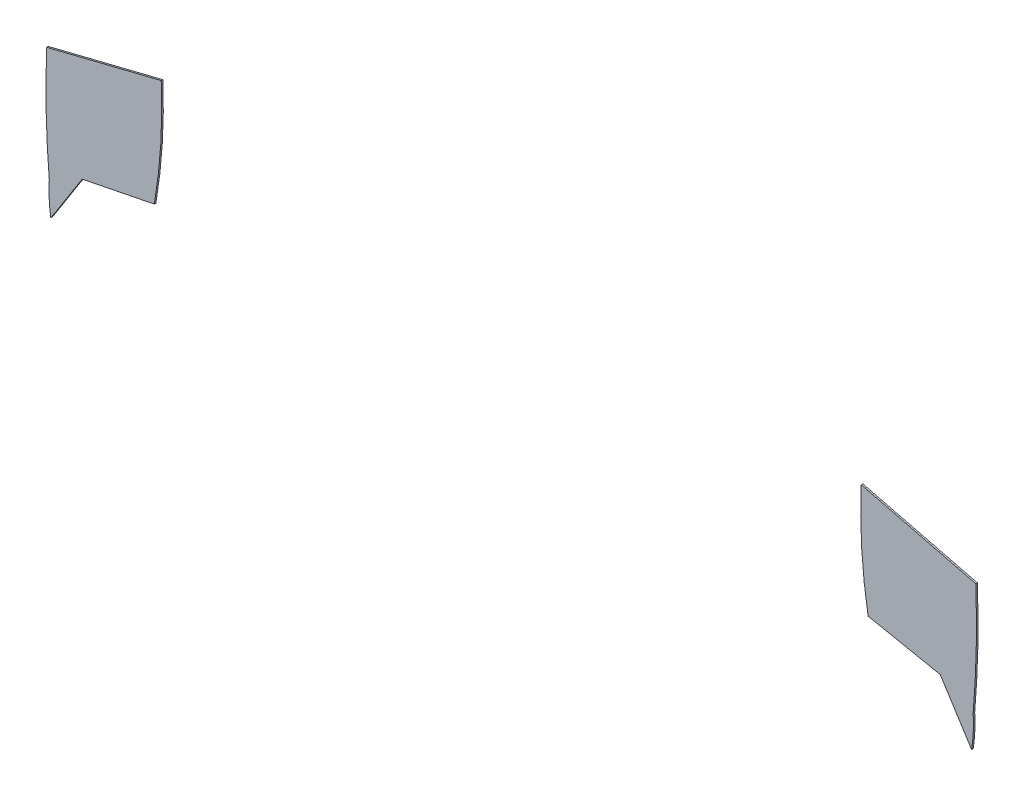
ISO-10303-21;
HEADER;
FILE_DESCRIPTION(('STEP AP214'),'2;1');
FILE_NAME('part.step','',(''),(''),'','','');
FILE_SCHEMA(('AUTOMOTIVE_DESIGN { 1 0 10303 214 1 1 1 1 }'));
ENDSEC;
DATA;
#1=APPLICATION_CONTEXT('core data for automotive mechanical design processes');
#2=APPLICATION_PROTOCOL_DEFINITION('international standard','automotive_design',2000,#1);
#3=PRODUCT_CONTEXT('',#1,'mechanical');
#4=PRODUCT('Part','Part','',(#3));
#5=PRODUCT_RELATED_PRODUCT_CATEGORY('part','',(#4));
#6=PRODUCT_DEFINITION_FORMATION('','',#4);
#7=PRODUCT_DEFINITION_CONTEXT('part definition',#1,'design');
#8=PRODUCT_DEFINITION('design','',#6,#7);
#9=PRODUCT_DEFINITION_SHAPE('','',#8);
#10=(LENGTH_UNIT() NAMED_UNIT(*) SI_UNIT(.MILLI.,.METRE.));
#11=(NAMED_UNIT(*) PLANE_ANGLE_UNIT() SI_UNIT($,.RADIAN.));
#12=(NAMED_UNIT(*) SI_UNIT($,.STERADIAN.) SOLID_ANGLE_UNIT());
#13=UNCERTAINTY_MEASURE_WITH_UNIT(LENGTH_MEASURE(1.E-05),#10,'distance_accuracy_value','');
#14=(GEOMETRIC_REPRESENTATION_CONTEXT(3) GLOBAL_UNCERTAINTY_ASSIGNED_CONTEXT((#13)) GLOBAL_UNIT_ASSIGNED_CONTEXT((#10,
#11,#12)) REPRESENTATION_CONTEXT('',''));
#15=CARTESIAN_POINT('',(0.,0.,0.));
#16=DIRECTION('',(0.,0.,1.));
#17=DIRECTION('',(1.,0.,0.));
#18=AXIS2_PLACEMENT_3D('',#15,#16,#17);
#19=CARTESIAN_POINT('',(90.4391239036947,-2.83923095815761,0.1));
#20=DIRECTION('',(0.,0.,-1.));
#21=DIRECTION('',(-1.,0.,0.));
#22=AXIS2_PLACEMENT_3D('',#19,#20,#21);
#23=CYLINDRICAL_SURFACE('',#22,33.1285196167318);
#24=CARTESIAN_POINT('',(90.4391239036947,-2.83923095815761,0.));
#25=DIRECTION('',(0.,0.,1.));
#26=DIRECTION('',(1.,0.,0.));
#27=AXIS2_PLACEMENT_3D('',#24,#25,#26);
#28=CIRCLE('',#27,33.1285196167318);
#29=CARTESIAN_POINT('',(57.3442733626371,-1.34601976705404,0.));
#30=VERTEX_POINT('',#29);
#31=CARTESIAN_POINT('',(57.7848375541781,-8.42460426707408,0.));
#32=VERTEX_POINT('',#31);
#33=EDGE_CURVE('E127',#30,#32,#28,.T.);
#34=ORIENTED_EDGE('',*,*,#33,.T.);
#35=DIRECTION('',(0.,0.,-1.));
#36=VECTOR('',#35,1.);
#37=CARTESIAN_POINT('',(57.7848375541781,-8.42460426707408,0.1));
#38=LINE('',#37,#36);
#39=CARTESIAN_POINT('',(57.7848375541781,-8.42460426707408,0.1));
#40=VERTEX_POINT('',#39);
#41=EDGE_CURVE('E12',#40,#32,#38,.T.);
#42=ORIENTED_EDGE('',*,*,#41,.F.);
#43=CARTESIAN_POINT('',(90.4391239036947,-2.83923095815761,0.1));
#44=DIRECTION('',(0.,0.,1.));
#45=DIRECTION('',(1.,0.,0.));
#46=AXIS2_PLACEMENT_3D('',#43,#44,#45);
#47=CIRCLE('',#46,33.1285196167318);
#48=CARTESIAN_POINT('',(57.3442733626371,-1.34601976705404,0.1));
#49=VERTEX_POINT('',#48);
#50=EDGE_CURVE('E137',#49,#40,#47,.T.);
#51=ORIENTED_EDGE('',*,*,#50,.F.);
#52=DIRECTION('',(0.,0.,-1.));
#53=VECTOR('',#52,1.);
#54=CARTESIAN_POINT('',(57.3442733626371,-1.34601976705404,0.1));
#55=LINE('',#54,#53);
#56=EDGE_CURVE('E123',#49,#30,#55,.T.);
#57=ORIENTED_EDGE('',*,*,#56,.T.);
#58=EDGE_LOOP('',(#34,#42,#51,#57));
#59=FACE_BOUND('',#58,.T.);
#60=ADVANCED_FACE('F43',(#59),#23,.T.);
#61=CARTESIAN_POINT('',(62.4057938002253,-9.3487955162835,0.1));
#62=DIRECTION('',(0.196116135138183,0.98058067569092,0.));
#63=DIRECTION('',(-0.98058067569092,0.196116135138183,0.));
#64=AXIS2_PLACEMENT_3D('',#61,#62,#63);
#65=PLANE('',#64);
#66=DIRECTION('',(0.98058067569092,-0.196116135138183,0.));
#67=VECTOR('',#66,1.);
#68=CARTESIAN_POINT('',(62.4057938002253,-9.3487955162835,0.));
#69=LINE('',#68,#67);
#70=CARTESIAN_POINT('',(62.4057938002253,-9.3487955162835,0.));
#71=VERTEX_POINT('',#70);
#72=EDGE_CURVE('E130',#32,#71,#69,.T.);
#73=ORIENTED_EDGE('',*,*,#72,.T.);
#74=DIRECTION('',(0.,0.,-1.));
#75=VECTOR('',#74,1.);
#76=CARTESIAN_POINT('',(62.4057938002253,-9.3487955162835,0.1));
#77=LINE('',#76,#75);
#78=CARTESIAN_POINT('',(62.4057938002253,-9.3487955162835,0.1));
#79=VERTEX_POINT('',#78);
#80=EDGE_CURVE('E51',#79,#71,#77,.T.);
#81=ORIENTED_EDGE('',*,*,#80,.F.);
#82=DIRECTION('',(0.98058067569092,-0.196116135138183,0.));
#83=VECTOR('',#82,1.);
#84=CARTESIAN_POINT('',(62.4057938002253,-9.3487955162835,0.1));
#85=LINE('',#84,#83);
#86=EDGE_CURVE('E95',#40,#79,#85,.T.);
#87=ORIENTED_EDGE('',*,*,#86,.F.);
#88=ORIENTED_EDGE('',*,*,#41,.T.);
#89=EDGE_LOOP('',(#73,#81,#87,#88));
#90=FACE_BOUND('',#89,.T.);
#91=ADVANCED_FACE('F161',(#90),#65,.F.);
#92=CARTESIAN_POINT('',(64.4194666396524,-12.5120472945828,0.1));
#93=DIRECTION('',(0.84357759621922,0.537007298979263,0.));
#94=DIRECTION('',(-0.537007298979263,0.84357759621922,0.));
#95=AXIS2_PLACEMENT_3D('',#92,#93,#94);
#96=PLANE('',#95);
#97=DIRECTION('',(0.537007298979263,-0.84357759621922,0.));
#98=VECTOR('',#97,1.);
#99=CARTESIAN_POINT('',(64.4194666396524,-12.5120472945828,0.));
#100=LINE('',#99,#98);
#101=CARTESIAN_POINT('',(64.4194666396524,-12.5120472945828,0.));
#102=VERTEX_POINT('',#101);
#103=EDGE_CURVE('E132',#71,#102,#100,.T.);
#104=ORIENTED_EDGE('',*,*,#103,.T.);
#105=DIRECTION('',(0.,0.,-1.));
#106=VECTOR('',#105,1.);
#107=CARTESIAN_POINT('',(64.4194666396524,-12.5120472945828,0.1));
#108=LINE('',#107,#106);
#109=CARTESIAN_POINT('',(64.4194666396524,-12.5120472945828,0.1));
#110=VERTEX_POINT('',#109);
#111=EDGE_CURVE('E118',#110,#102,#108,.T.);
#112=ORIENTED_EDGE('',*,*,#111,.F.);
#113=DIRECTION('',(0.537007298979263,-0.84357759621922,0.));
#114=VECTOR('',#113,1.);
#115=CARTESIAN_POINT('',(64.4194666396524,-12.5120472945828,0.1));
#116=LINE('',#115,#114);
#117=EDGE_CURVE('E108',#79,#110,#116,.T.);
#118=ORIENTED_EDGE('',*,*,#117,.F.);
#119=ORIENTED_EDGE('',*,*,#80,.T.);
#120=EDGE_LOOP('',(#104,#112,#118,#119));
#121=FACE_BOUND('',#120,.T.);
#122=ADVANCED_FACE('F143',(#121),#96,.F.);
#123=CARTESIAN_POINT('',(55.5715399284181,-11.0502256806477,0.1));
#124=DIRECTION('',(0.,0.,-1.));
#125=DIRECTION('',(-1.,0.,0.));
#126=AXIS2_PLACEMENT_3D('',#123,#124,#125);
#127=CYLINDRICAL_SURFACE('',#126,8.96787207303605);
#128=CARTESIAN_POINT('',(55.5715399284181,-11.0502256806477,0.));
#129=DIRECTION('',(0.,0.,1.));
#130=DIRECTION('',(1.,0.,0.));
#131=AXIS2_PLACEMENT_3D('',#128,#129,#130);
#132=CIRCLE('',#131,8.96787207303605);
#133=CARTESIAN_POINT('',(64.5173910559765,-10.422151543382,0.));
#134=VERTEX_POINT('',#133);
#135=EDGE_CURVE('E117',#102,#134,#132,.T.);
#136=ORIENTED_EDGE('',*,*,#135,.T.);
#137=DIRECTION('',(0.,0.,-1.));
#138=VECTOR('',#137,1.);
#139=CARTESIAN_POINT('',(64.5173910559765,-10.422151543382,0.1));
#140=LINE('',#139,#138);
#141=CARTESIAN_POINT('',(64.5173910559765,-10.422151543382,0.1));
#142=VERTEX_POINT('',#141);
#143=EDGE_CURVE('E114',#142,#134,#140,.T.);
#144=ORIENTED_EDGE('',*,*,#143,.F.);
#145=CARTESIAN_POINT('',(55.5715399284181,-11.0502256806477,0.1));
#146=DIRECTION('',(0.,0.,1.));
#147=DIRECTION('',(1.,0.,0.));
#148=AXIS2_PLACEMENT_3D('',#145,#146,#147);
#149=CIRCLE('',#148,8.96787207303605);
#150=EDGE_CURVE('E102',#110,#142,#149,.T.);
#151=ORIENTED_EDGE('',*,*,#150,.F.);
#152=ORIENTED_EDGE('',*,*,#111,.T.);
#153=EDGE_LOOP('',(#136,#144,#151,#152));
#154=FACE_BOUND('',#153,.T.);
#155=ADVANCED_FACE('F115',(#154),#127,.T.);
#156=CARTESIAN_POINT('',(6.9370145575896,-5.46520608903776,0.1));
#157=DIRECTION('',(0.,0.,-1.));
#158=DIRECTION('',(-1.,0.,0.));
#159=AXIS2_PLACEMENT_3D('',#156,#157,#158);
#160=CYLINDRICAL_SURFACE('',#159,57.7933479384378);
#161=CARTESIAN_POINT('',(6.9370145575896,-5.46520608903776,0.));
#162=DIRECTION('',(0.,0.,1.));
#163=DIRECTION('',(1.,0.,0.));
#164=AXIS2_PLACEMENT_3D('',#161,#162,#163);
#165=CIRCLE('',#164,57.7933479384378);
#166=CARTESIAN_POINT('',(64.6847099213511,-3.16852454656493,0.));
#167=VERTEX_POINT('',#166);
#168=EDGE_CURVE('E81',#134,#167,#165,.T.);
#169=ORIENTED_EDGE('',*,*,#168,.T.);
#170=DIRECTION('',(0.,0.,-1.));
#171=VECTOR('',#170,1.);
#172=CARTESIAN_POINT('',(64.6847099213511,-3.16852454656493,0.1));
#173=LINE('',#172,#171);
#174=CARTESIAN_POINT('',(64.6847099213511,-3.16852454656493,0.1));
#175=VERTEX_POINT('',#174);
#176=EDGE_CURVE('E119',#175,#167,#173,.T.);
#177=ORIENTED_EDGE('',*,*,#176,.F.);
#178=CARTESIAN_POINT('',(6.9370145575896,-5.46520608903776,0.1));
#179=DIRECTION('',(0.,0.,1.));
#180=DIRECTION('',(1.,0.,0.));
#181=AXIS2_PLACEMENT_3D('',#178,#179,#180);
#182=CIRCLE('',#181,57.7933479384378);
#183=EDGE_CURVE('E106',#142,#175,#182,.T.);
#184=ORIENTED_EDGE('',*,*,#183,.F.);
#185=ORIENTED_EDGE('',*,*,#143,.T.);
#186=EDGE_LOOP('',(#169,#177,#184,#185));
#187=FACE_BOUND('',#186,.T.);
#188=ADVANCED_FACE('F121',(#187),#160,.T.);
#189=CARTESIAN_POINT('',(57.3442733626371,-1.34601976705404,0.1));
#190=DIRECTION('',(-0.240966822794949,-0.970533353528928,0.));
#191=DIRECTION('',(0.970533353528928,-0.240966822794949,0.));
#192=AXIS2_PLACEMENT_3D('',#189,#190,#191);
#193=PLANE('',#192);
#194=DIRECTION('',(-0.970533353528928,0.240966822794949,0.));
#195=VECTOR('',#194,1.);
#196=CARTESIAN_POINT('',(57.3442733626371,-1.34601976705404,0.));
#197=LINE('',#196,#195);
#198=EDGE_CURVE('E87',#167,#30,#197,.T.);
#199=ORIENTED_EDGE('',*,*,#198,.T.);
#200=ORIENTED_EDGE('',*,*,#56,.F.);
#201=DIRECTION('',(-0.970533353528928,0.240966822794949,0.));
#202=VECTOR('',#201,1.);
#203=CARTESIAN_POINT('',(57.3442733626371,-1.34601976705404,0.1));
#204=LINE('',#203,#202);
#205=EDGE_CURVE('E59',#175,#49,#204,.T.);
#206=ORIENTED_EDGE('',*,*,#205,.F.);
#207=ORIENTED_EDGE('',*,*,#176,.T.);
#208=EDGE_LOOP('',(#199,#200,#206,#207));
#209=FACE_BOUND('',#208,.T.);
#210=ADVANCED_FACE('F150',(#209),#193,.F.);
#211=CARTESIAN_POINT('',(90.4391239036947,-2.83923095815761,0.1));
#212=DIRECTION('',(0.,0.,1.));
#213=DIRECTION('',(1.,0.,0.));
#214=AXIS2_PLACEMENT_3D('',#211,#212,#213);
#215=PLANE('',#214);
#216=ORIENTED_EDGE('',*,*,#50,.T.);
#217=ORIENTED_EDGE('',*,*,#86,.T.);
#218=ORIENTED_EDGE('',*,*,#117,.T.);
#219=ORIENTED_EDGE('',*,*,#150,.T.);
#220=ORIENTED_EDGE('',*,*,#183,.T.);
#221=ORIENTED_EDGE('',*,*,#205,.T.);
#222=EDGE_LOOP('',(#216,#217,#218,#219,#220,#221));
#223=FACE_BOUND('',#222,.T.);
#224=ADVANCED_FACE('F104',(#223),#215,.T.);
#225=CARTESIAN_POINT('',(90.4391239036947,-2.83923095815761,0.));
#226=DIRECTION('',(0.,0.,1.));
#227=DIRECTION('',(1.,0.,0.));
#228=AXIS2_PLACEMENT_3D('',#225,#226,#227);
#229=PLANE('',#228);
#230=ORIENTED_EDGE('',*,*,#33,.F.);
#231=ORIENTED_EDGE('',*,*,#198,.F.);
#232=ORIENTED_EDGE('',*,*,#168,.F.);
#233=ORIENTED_EDGE('',*,*,#135,.F.);
#234=ORIENTED_EDGE('',*,*,#103,.F.);
#235=ORIENTED_EDGE('',*,*,#72,.F.);
#236=EDGE_LOOP('',(#230,#231,#232,#233,#234,#235));
#237=FACE_BOUND('',#236,.T.);
#238=ADVANCED_FACE('F146',(#237),#229,.F.);
#239=CLOSED_SHELL('',(#60,#91,#122,#155,#188,#210,#224,#238));
#240=MANIFOLD_SOLID_BREP('B2',#239);
#241=CARTESIAN_POINT('',(63.0462782931808,-5.489167462537,0.1));
#242=DIRECTION('',(0.,0.,-1.));
#243=DIRECTION('',(-1.,0.,0.));
#244=AXIS2_PLACEMENT_3D('',#241,#242,#243);
#245=CYLINDRICAL_SURFACE('',#244,57.9645015328712);
#246=CARTESIAN_POINT('',(63.0462782931808,-5.489167462537,0.));
#247=DIRECTION('',(0.,0.,1.));
#248=DIRECTION('',(1.,0.,0.));
#249=AXIS2_PLACEMENT_3D('',#246,#247,#248);
#250=CIRCLE('',#249,57.9645015328712);
#251=CARTESIAN_POINT('',(5.12828966293286,-3.16752343713269,0.));
#252=VERTEX_POINT('',#251);
#253=CARTESIAN_POINT('',(5.29385373676021,-10.4430443089244,0.));
#254=VERTEX_POINT('',#253);
#255=EDGE_CURVE('E306',#252,#254,#250,.T.);
#256=ORIENTED_EDGE('',*,*,#255,.T.);
#257=DIRECTION('',(0.,0.,-1.));
#258=VECTOR('',#257,1.);
#259=CARTESIAN_POINT('',(5.29385373676021,-10.4430443089244,0.1));
#260=LINE('',#259,#258);
#261=CARTESIAN_POINT('',(5.29385373676021,-10.4430443089244,0.1));
#262=VERTEX_POINT('',#261);
#263=EDGE_CURVE('E41',#262,#254,#260,.T.);
#264=ORIENTED_EDGE('',*,*,#263,.F.);
#265=CARTESIAN_POINT('',(63.0462782931808,-5.489167462537,0.1));
#266=DIRECTION('',(0.,0.,1.));
#267=DIRECTION('',(1.,0.,0.));
#268=AXIS2_PLACEMENT_3D('',#265,#266,#267);
#269=CIRCLE('',#268,57.9645015328712);
#270=CARTESIAN_POINT('',(5.12828966293286,-3.16752343713269,0.1));
#271=VERTEX_POINT('',#270);
#272=EDGE_CURVE('E316',#271,#262,#269,.T.);
#273=ORIENTED_EDGE('',*,*,#272,.F.);
#274=DIRECTION('',(0.,0.,-1.));
#275=VECTOR('',#274,1.);
#276=CARTESIAN_POINT('',(5.12828966293286,-3.16752343713269,0.1));
#277=LINE('',#276,#275);
#278=EDGE_CURVE('E302',#271,#252,#277,.T.);
#279=ORIENTED_EDGE('',*,*,#278,.T.);
#280=EDGE_LOOP('',(#256,#264,#273,#279));
#281=FACE_BOUND('',#280,.T.);
#282=ADVANCED_FACE('F222',(#281),#245,.T.);
#283=CARTESIAN_POINT('',(14.209967819523,-11.0510297976185,0.1));
#284=DIRECTION('',(0.,0.,-1.));
#285=DIRECTION('',(-1.,0.,0.));
#286=AXIS2_PLACEMENT_3D('',#283,#284,#285);
#287=CYLINDRICAL_SURFACE('',#286,8.93681915959498);
#288=CARTESIAN_POINT('',(14.209967819523,-11.0510297976185,0.));
#289=DIRECTION('',(0.,0.,1.));
#290=DIRECTION('',(1.,0.,0.));
#291=AXIS2_PLACEMENT_3D('',#288,#289,#290);
#292=CIRCLE('',#291,8.93681915959498);
#293=CARTESIAN_POINT('',(5.39321882591242,-12.5110550970468,0.));
#294=VERTEX_POINT('',#293);
#295=EDGE_CURVE('E309',#254,#294,#292,.T.);
#296=ORIENTED_EDGE('',*,*,#295,.T.);
#297=DIRECTION('',(0.,0.,-1.));
#298=VECTOR('',#297,1.);
#299=CARTESIAN_POINT('',(5.39321882591242,-12.5110550970468,0.1));
#300=LINE('',#299,#298);
#301=CARTESIAN_POINT('',(5.39321882591242,-12.5110550970468,0.1));
#302=VERTEX_POINT('',#301);
#303=EDGE_CURVE('E230',#302,#294,#300,.T.);
#304=ORIENTED_EDGE('',*,*,#303,.F.);
#305=CARTESIAN_POINT('',(14.209967819523,-11.0510297976185,0.1));
#306=DIRECTION('',(0.,0.,1.));
#307=DIRECTION('',(1.,0.,0.));
#308=AXIS2_PLACEMENT_3D('',#305,#306,#307);
#309=CIRCLE('',#308,8.93681915959498);
#310=EDGE_CURVE('E275',#262,#302,#309,.T.);
#311=ORIENTED_EDGE('',*,*,#310,.F.);
#312=ORIENTED_EDGE('',*,*,#263,.T.);
#313=EDGE_LOOP('',(#296,#304,#311,#312));
#314=FACE_BOUND('',#313,.T.);
#315=ADVANCED_FACE('F340',(#314),#287,.T.);
#316=CARTESIAN_POINT('',(5.39321882591242,-12.5110550970468,0.1));
#317=DIRECTION('',(-0.84355954217012,0.537035658791609,0.));
#318=DIRECTION('',(-0.537035658791609,-0.84355954217012,0.));
#319=AXIS2_PLACEMENT_3D('',#316,#317,#318);
#320=PLANE('',#319);
#321=DIRECTION('',(0.537035658791609,0.84355954217012,0.));
#322=VECTOR('',#321,1.);
#323=CARTESIAN_POINT('',(5.39321882591242,-12.5110550970468,0.));
#324=LINE('',#323,#322);
#325=CARTESIAN_POINT('',(7.40699800911539,-9.34787101791737,0.));
#326=VERTEX_POINT('',#325);
#327=EDGE_CURVE('E311',#294,#326,#324,.T.);
#328=ORIENTED_EDGE('',*,*,#327,.T.);
#329=DIRECTION('',(0.,0.,-1.));
#330=VECTOR('',#329,1.);
#331=CARTESIAN_POINT('',(7.40699800911539,-9.34787101791737,0.1));
#332=LINE('',#331,#330);
#333=CARTESIAN_POINT('',(7.40699800911539,-9.34787101791737,0.1));
#334=VERTEX_POINT('',#333);
#335=EDGE_CURVE('E297',#334,#326,#332,.T.);
#336=ORIENTED_EDGE('',*,*,#335,.F.);
#337=DIRECTION('',(0.537035658791609,0.84355954217012,0.));
#338=VECTOR('',#337,1.);
#339=CARTESIAN_POINT('',(5.39321882591242,-12.5110550970468,0.1));
#340=LINE('',#339,#338);
#341=EDGE_CURVE('E288',#302,#334,#340,.T.);
#342=ORIENTED_EDGE('',*,*,#341,.F.);
#343=ORIENTED_EDGE('',*,*,#303,.T.);
#344=EDGE_LOOP('',(#328,#336,#342,#343));
#345=FACE_BOUND('',#344,.T.);
#346=ADVANCED_FACE('F322',(#345),#320,.F.);
#347=CARTESIAN_POINT('',(7.40699800911539,-9.34787101791737,0.1));
#348=DIRECTION('',(-0.196083169024405,0.980587268337371,0.));
#349=DIRECTION('',(-0.980587268337371,-0.196083169024405,0.));
#350=AXIS2_PLACEMENT_3D('',#347,#348,#349);
#351=PLANE('',#350);
#352=DIRECTION('',(0.980587268337371,0.196083169024405,0.));
#353=VECTOR('',#352,1.);
#354=CARTESIAN_POINT('',(7.40699800911539,-9.34787101791737,0.));
#355=LINE('',#354,#353);
#356=CARTESIAN_POINT('',(12.027985322806,-8.42383512050423,0.));
#357=VERTEX_POINT('',#356);
#358=EDGE_CURVE('E296',#326,#357,#355,.T.);
#359=ORIENTED_EDGE('',*,*,#358,.T.);
#360=DIRECTION('',(0.,0.,-1.));
#361=VECTOR('',#360,1.);
#362=CARTESIAN_POINT('',(12.027985322806,-8.42383512050423,0.1));
#363=LINE('',#362,#361);
#364=CARTESIAN_POINT('',(12.027985322806,-8.42383512050423,0.1));
#365=VERTEX_POINT('',#364);
#366=EDGE_CURVE('E293',#365,#357,#363,.T.);
#367=ORIENTED_EDGE('',*,*,#366,.F.);
#368=DIRECTION('',(0.980587268337371,0.196083169024405,0.));
#369=VECTOR('',#368,1.);
#370=CARTESIAN_POINT('',(7.40699800911539,-9.34787101791737,0.1));
#371=LINE('',#370,#369);
#372=EDGE_CURVE('E282',#334,#365,#371,.T.);
#373=ORIENTED_EDGE('',*,*,#372,.F.);
#374=ORIENTED_EDGE('',*,*,#335,.T.);
#375=EDGE_LOOP('',(#359,#367,#373,#374));
#376=FACE_BOUND('',#375,.T.);
#377=ADVANCED_FACE('F294',(#376),#351,.F.);
#378=CARTESIAN_POINT('',(-20.4208720344938,-2.84211470326521,0.1));
#379=DIRECTION('',(0.,0.,-1.));
#380=DIRECTION('',(-1.,0.,0.));
#381=AXIS2_PLACEMENT_3D('',#378,#379,#380);
#382=CYLINDRICAL_SURFACE('',#381,32.9254300899869);
#383=CARTESIAN_POINT('',(-20.4208720344938,-2.84211470326521,0.));
#384=DIRECTION('',(0.,0.,1.));
#385=DIRECTION('',(1.,0.,0.));
#386=AXIS2_PLACEMENT_3D('',#383,#384,#385);
#387=CIRCLE('',#386,32.9254300899869);
#388=CARTESIAN_POINT('',(12.4705121397057,-1.34518661019316,0.));
#389=VERTEX_POINT('',#388);
#390=EDGE_CURVE('E261',#357,#389,#387,.T.);
#391=ORIENTED_EDGE('',*,*,#390,.T.);
#392=DIRECTION('',(0.,0.,-1.));
#393=VECTOR('',#392,1.);
#394=CARTESIAN_POINT('',(12.4705121397057,-1.34518661019316,0.1));
#395=LINE('',#394,#393);
#396=CARTESIAN_POINT('',(12.4705121397057,-1.34518661019316,0.1));
#397=VERTEX_POINT('',#396);
#398=EDGE_CURVE('E298',#397,#389,#395,.T.);
#399=ORIENTED_EDGE('',*,*,#398,.F.);
#400=CARTESIAN_POINT('',(-20.4208720344938,-2.84211470326521,0.1));
#401=DIRECTION('',(0.,0.,1.));
#402=DIRECTION('',(1.,0.,0.));
#403=AXIS2_PLACEMENT_3D('',#400,#401,#402);
#404=CIRCLE('',#403,32.9254300899869);
#405=EDGE_CURVE('E286',#365,#397,#404,.T.);
#406=ORIENTED_EDGE('',*,*,#405,.F.);
#407=ORIENTED_EDGE('',*,*,#366,.T.);
#408=EDGE_LOOP('',(#391,#399,#406,#407));
#409=FACE_BOUND('',#408,.T.);
#410=ADVANCED_FACE('F300',(#409),#382,.T.);
#411=CARTESIAN_POINT('',(12.4705121397057,-1.34518661019316,0.1));
#412=DIRECTION('',(0.240890699524116,-0.970552250465055,0.));
#413=DIRECTION('',(0.970552250465055,0.240890699524116,0.));
#414=AXIS2_PLACEMENT_3D('',#411,#412,#413);
#415=PLANE('',#414);
#416=DIRECTION('',(-0.970552250465055,-0.240890699524116,0.));
#417=VECTOR('',#416,1.);
#418=CARTESIAN_POINT('',(12.4705121397057,-1.34518661019316,0.));
#419=LINE('',#418,#417);
#420=EDGE_CURVE('E267',#389,#252,#419,.T.);
#421=ORIENTED_EDGE('',*,*,#420,.T.);
#422=ORIENTED_EDGE('',*,*,#278,.F.);
#423=DIRECTION('',(-0.970552250465055,-0.240890699524116,0.));
#424=VECTOR('',#423,1.);
#425=CARTESIAN_POINT('',(12.4705121397057,-1.34518661019316,0.1));
#426=LINE('',#425,#424);
#427=EDGE_CURVE('E238',#397,#271,#426,.T.);
#428=ORIENTED_EDGE('',*,*,#427,.F.);
#429=ORIENTED_EDGE('',*,*,#398,.T.);
#430=EDGE_LOOP('',(#421,#422,#428,#429));
#431=FACE_BOUND('',#430,.T.);
#432=ADVANCED_FACE('F329',(#431),#415,.F.);
#433=CARTESIAN_POINT('',(63.0462782931808,-5.489167462537,0.1));
#434=DIRECTION('',(0.,0.,1.));
#435=DIRECTION('',(1.,0.,0.));
#436=AXIS2_PLACEMENT_3D('',#433,#434,#435);
#437=PLANE('',#436);
#438=ORIENTED_EDGE('',*,*,#272,.T.);
#439=ORIENTED_EDGE('',*,*,#310,.T.);
#440=ORIENTED_EDGE('',*,*,#341,.T.);
#441=ORIENTED_EDGE('',*,*,#372,.T.);
#442=ORIENTED_EDGE('',*,*,#405,.T.);
#443=ORIENTED_EDGE('',*,*,#427,.T.);
#444=EDGE_LOOP('',(#438,#439,#440,#441,#442,#443));
#445=FACE_BOUND('',#444,.T.);
#446=ADVANCED_FACE('F284',(#445),#437,.T.);
#447=CARTESIAN_POINT('',(63.0462782931808,-5.489167462537,0.));
#448=DIRECTION('',(0.,0.,1.));
#449=DIRECTION('',(1.,0.,0.));
#450=AXIS2_PLACEMENT_3D('',#447,#448,#449);
#451=PLANE('',#450);
#452=ORIENTED_EDGE('',*,*,#255,.F.);
#453=ORIENTED_EDGE('',*,*,#420,.F.);
#454=ORIENTED_EDGE('',*,*,#390,.F.);
#455=ORIENTED_EDGE('',*,*,#358,.F.);
#456=ORIENTED_EDGE('',*,*,#327,.F.);
#457=ORIENTED_EDGE('',*,*,#295,.F.);
#458=EDGE_LOOP('',(#452,#453,#454,#455,#456,#457));
#459=FACE_BOUND('',#458,.T.);
#460=ADVANCED_FACE('F325',(#459),#451,.F.);
#461=CLOSED_SHELL('',(#282,#315,#346,#377,#410,#432,#446,#460));
#462=MANIFOLD_SOLID_BREP('B6',#461);
#463=ADVANCED_BREP_SHAPE_REPRESENTATION('',(#18,#240,#462),#14);
#464=SHAPE_DEFINITION_REPRESENTATION(#9,#463);
ENDSEC;
END-ISO-10303-21;
